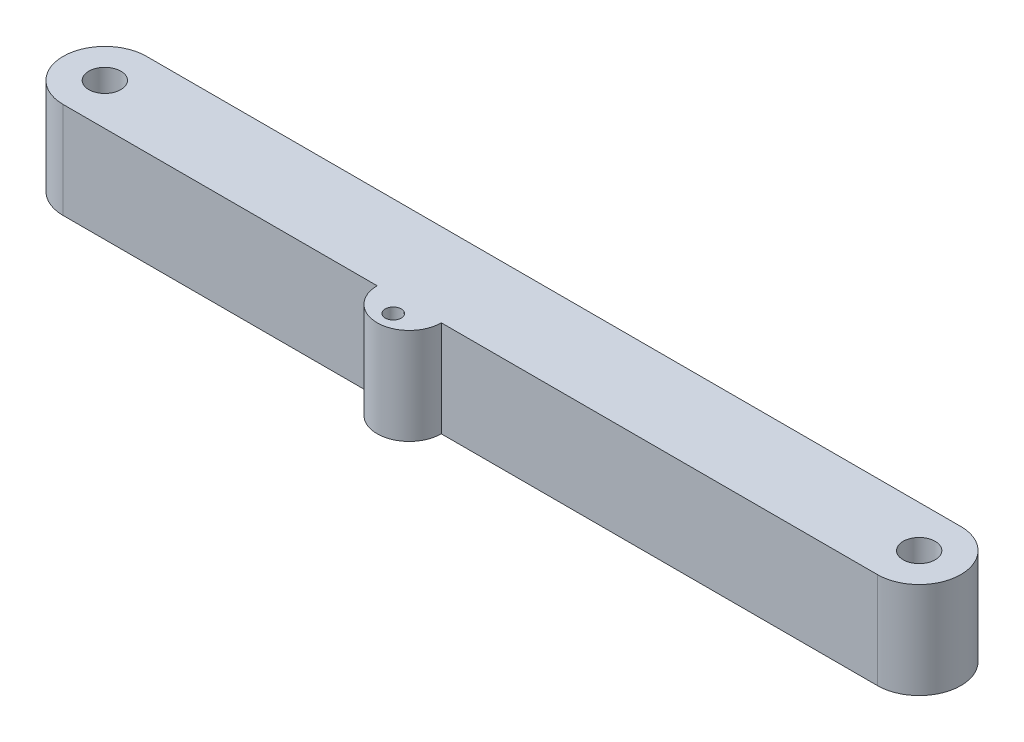
ISO-10303-21;
HEADER;
FILE_DESCRIPTION(('STEP AP214'),'2;1');
FILE_NAME('part.step','',(''),(''),'','','');
FILE_SCHEMA(('AUTOMOTIVE_DESIGN { 1 0 10303 214 1 1 1 1 }'));
ENDSEC;
DATA;
#1=APPLICATION_CONTEXT('core data for automotive mechanical design processes');
#2=APPLICATION_PROTOCOL_DEFINITION('international standard','automotive_design',2000,#1);
#3=PRODUCT_CONTEXT('',#1,'mechanical');
#4=PRODUCT('Part','Part','',(#3));
#5=PRODUCT_RELATED_PRODUCT_CATEGORY('part','',(#4));
#6=PRODUCT_DEFINITION_FORMATION('','',#4);
#7=PRODUCT_DEFINITION_CONTEXT('part definition',#1,'design');
#8=PRODUCT_DEFINITION('design','',#6,#7);
#9=PRODUCT_DEFINITION_SHAPE('','',#8);
#10=(LENGTH_UNIT() NAMED_UNIT(*) SI_UNIT(.MILLI.,.METRE.));
#11=(NAMED_UNIT(*) PLANE_ANGLE_UNIT() SI_UNIT($,.RADIAN.));
#12=(NAMED_UNIT(*) SI_UNIT($,.STERADIAN.) SOLID_ANGLE_UNIT());
#13=UNCERTAINTY_MEASURE_WITH_UNIT(LENGTH_MEASURE(1.E-05),#10,'distance_accuracy_value','');
#14=(GEOMETRIC_REPRESENTATION_CONTEXT(3) GLOBAL_UNCERTAINTY_ASSIGNED_CONTEXT((#13)) GLOBAL_UNIT_ASSIGNED_CONTEXT((#10,
#11,#12)) REPRESENTATION_CONTEXT('',''));
#15=CARTESIAN_POINT('',(0.,0.,0.));
#16=DIRECTION('',(0.,0.,1.));
#17=DIRECTION('',(1.,0.,0.));
#18=AXIS2_PLACEMENT_3D('',#15,#16,#17);
#19=CARTESIAN_POINT('',(-80.645,19.05,8.255));
#20=DIRECTION('',(0.,0.,-1.));
#21=DIRECTION('',(-1.,0.,0.));
#22=AXIS2_PLACEMENT_3D('',#19,#20,#21);
#23=PLANE('',#22);
#24=DIRECTION('',(1.,0.,0.));
#25=VECTOR('',#24,1.);
#26=CARTESIAN_POINT('',(-80.645,0.,8.255));
#27=LINE('',#26,#25);
#28=CARTESIAN_POINT('',(-80.645,0.,8.255));
#29=VERTEX_POINT('',#28);
#30=CARTESIAN_POINT('',(-18.4476136,0.,8.255));
#31=VERTEX_POINT('',#30);
#32=EDGE_CURVE('E98',#29,#31,#27,.T.);
#33=ORIENTED_EDGE('',*,*,#32,.T.);
#34=DIRECTION('',(0.,1.,0.));
#35=VECTOR('',#34,1.);
#36=CARTESIAN_POINT('',(-18.4476136,-14.1990316571237,8.255));
#37=LINE('',#36,#35);
#38=CARTESIAN_POINT('',(-18.4476136,19.05,8.255));
#39=VERTEX_POINT('',#38);
#40=EDGE_CURVE('E58',#31,#39,#37,.T.);
#41=ORIENTED_EDGE('',*,*,#40,.T.);
#42=DIRECTION('',(1.,0.,0.));
#43=VECTOR('',#42,1.);
#44=CARTESIAN_POINT('',(-80.645,19.05,8.255));
#45=LINE('',#44,#43);
#46=CARTESIAN_POINT('',(-80.645,19.05,8.255));
#47=VERTEX_POINT('',#46);
#48=EDGE_CURVE('E135',#47,#39,#45,.T.);
#49=ORIENTED_EDGE('',*,*,#48,.F.);
#50=DIRECTION('',(0.,-1.,0.));
#51=VECTOR('',#50,1.);
#52=CARTESIAN_POINT('',(-80.645,19.05,8.255));
#53=LINE('',#52,#51);
#54=EDGE_CURVE('E11',#47,#29,#53,.T.);
#55=ORIENTED_EDGE('',*,*,#54,.T.);
#56=EDGE_LOOP('',(#33,#41,#49,#55));
#57=FACE_BOUND('',#56,.T.);
#58=ADVANCED_FACE('F35',(#57),#23,.F.);
#59=CARTESIAN_POINT('',(-80.645,19.05,0.));
#60=DIRECTION('',(0.,1.,0.));
#61=DIRECTION('',(0.,0.,1.));
#62=AXIS2_PLACEMENT_3D('',#59,#60,#61);
#63=PLANE('',#62);
#64=CARTESIAN_POINT('',(-80.645,19.05,0.));
#65=DIRECTION('',(0.,1.,0.));
#66=DIRECTION('',(0.,0.,1.));
#67=AXIS2_PLACEMENT_3D('',#64,#65,#66);
#68=CIRCLE('',#67,3.175);
#69=CARTESIAN_POINT('',(-80.645,19.05,3.175));
#70=VERTEX_POINT('',#69);
#71=EDGE_CURVE('E126',#70,#70,#68,.T.);
#72=ORIENTED_EDGE('',*,*,#71,.F.);
#73=EDGE_LOOP('',(#72));
#74=FACE_BOUND('',#73,.T.);
#75=CARTESIAN_POINT('',(-80.645,19.05,0.));
#76=DIRECTION('',(0.,1.,0.));
#77=DIRECTION('',(0.,0.,1.));
#78=AXIS2_PLACEMENT_3D('',#75,#76,#77);
#79=CIRCLE('',#78,8.255);
#80=CARTESIAN_POINT('',(-80.645,19.05,-8.255));
#81=VERTEX_POINT('',#80);
#82=EDGE_CURVE('E131',#81,#47,#79,.T.);
#83=ORIENTED_EDGE('',*,*,#82,.T.);
#84=ORIENTED_EDGE('',*,*,#48,.T.);
#85=CARTESIAN_POINT('',(-12.0976136,19.05,8.255));
#86=DIRECTION('',(0.,1.,0.));
#87=DIRECTION('',(0.,0.,1.));
#88=AXIS2_PLACEMENT_3D('',#85,#86,#87);
#89=CIRCLE('',#88,6.35);
#90=CARTESIAN_POINT('',(-5.74761360000001,19.05,8.255));
#91=VERTEX_POINT('',#90);
#92=EDGE_CURVE('E106',#39,#91,#89,.T.);
#93=ORIENTED_EDGE('',*,*,#92,.T.);
#94=CARTESIAN_POINT('',(80.645,19.05,8.255));
#95=VERTEX_POINT('',#94);
#96=EDGE_CURVE('E50',#91,#95,#45,.T.);
#97=ORIENTED_EDGE('',*,*,#96,.T.);
#98=CARTESIAN_POINT('',(80.645,19.05,0.));
#99=DIRECTION('',(0.,1.,0.));
#100=DIRECTION('',(0.,0.,-1.));
#101=AXIS2_PLACEMENT_3D('',#98,#99,#100);
#102=CIRCLE('',#101,8.255);
#103=CARTESIAN_POINT('',(80.645,19.05,-8.255));
#104=VERTEX_POINT('',#103);
#105=EDGE_CURVE('E137',#95,#104,#102,.T.);
#106=ORIENTED_EDGE('',*,*,#105,.T.);
#107=DIRECTION('',(-1.,0.,0.));
#108=VECTOR('',#107,1.);
#109=CARTESIAN_POINT('',(-80.645,19.05,-8.255));
#110=LINE('',#109,#108);
#111=EDGE_CURVE('E139',#104,#81,#110,.T.);
#112=ORIENTED_EDGE('',*,*,#111,.T.);
#113=EDGE_LOOP('',(#83,#84,#93,#97,#106,#112));
#114=FACE_BOUND('',#113,.T.);
#115=CARTESIAN_POINT('',(80.645,19.05,0.));
#116=DIRECTION('',(0.,1.,0.));
#117=DIRECTION('',(0.,0.,1.));
#118=AXIS2_PLACEMENT_3D('',#115,#116,#117);
#119=CIRCLE('',#118,3.175);
#120=CARTESIAN_POINT('',(80.645,19.05,3.175));
#121=VERTEX_POINT('',#120);
#122=EDGE_CURVE('E120',#121,#121,#119,.T.);
#123=ORIENTED_EDGE('',*,*,#122,.F.);
#124=EDGE_LOOP('',(#123));
#125=FACE_BOUND('',#124,.T.);
#126=CARTESIAN_POINT('',(-12.0976136,19.05,11.43));
#127=DIRECTION('',(0.,1.,0.));
#128=DIRECTION('',(0.,0.,1.));
#129=AXIS2_PLACEMENT_3D('',#126,#127,#128);
#130=CIRCLE('',#129,1.5875);
#131=CARTESIAN_POINT('',(-12.0976136,19.05,13.0175));
#132=VERTEX_POINT('',#131);
#133=EDGE_CURVE('E116',#132,#132,#130,.T.);
#134=ORIENTED_EDGE('',*,*,#133,.F.);
#135=EDGE_LOOP('',(#134));
#136=FACE_BOUND('',#135,.T.);
#137=ADVANCED_FACE('F156',(#74,#114,#125,#136),#63,.T.);
#138=CARTESIAN_POINT('',(-80.645,0.,0.));
#139=DIRECTION('',(0.,1.,0.));
#140=DIRECTION('',(0.,0.,1.));
#141=AXIS2_PLACEMENT_3D('',#138,#139,#140);
#142=PLANE('',#141);
#143=CARTESIAN_POINT('',(-80.645,0.,0.));
#144=DIRECTION('',(0.,1.,0.));
#145=DIRECTION('',(0.,0.,1.));
#146=AXIS2_PLACEMENT_3D('',#143,#144,#145);
#147=CIRCLE('',#146,8.255);
#148=CARTESIAN_POINT('',(-80.645,0.,-8.255));
#149=VERTEX_POINT('',#148);
#150=EDGE_CURVE('E99',#149,#29,#147,.T.);
#151=ORIENTED_EDGE('',*,*,#150,.F.);
#152=DIRECTION('',(-1.,0.,0.));
#153=VECTOR('',#152,1.);
#154=CARTESIAN_POINT('',(-80.645,0.,-8.255));
#155=LINE('',#154,#153);
#156=CARTESIAN_POINT('',(80.645,0.,-8.255));
#157=VERTEX_POINT('',#156);
#158=EDGE_CURVE('E134',#157,#149,#155,.T.);
#159=ORIENTED_EDGE('',*,*,#158,.F.);
#160=CARTESIAN_POINT('',(80.645,0.,0.));
#161=DIRECTION('',(0.,1.,0.));
#162=DIRECTION('',(0.,0.,-1.));
#163=AXIS2_PLACEMENT_3D('',#160,#161,#162);
#164=CIRCLE('',#163,8.255);
#165=CARTESIAN_POINT('',(80.645,0.,8.255));
#166=VERTEX_POINT('',#165);
#167=EDGE_CURVE('E96',#166,#157,#164,.T.);
#168=ORIENTED_EDGE('',*,*,#167,.F.);
#169=CARTESIAN_POINT('',(-5.7476136,0.,8.255));
#170=VERTEX_POINT('',#169);
#171=EDGE_CURVE('E89',#170,#166,#27,.T.);
#172=ORIENTED_EDGE('',*,*,#171,.F.);
#173=CARTESIAN_POINT('',(-12.0976136,0.,8.255));
#174=DIRECTION('',(0.,1.,0.));
#175=DIRECTION('',(0.,0.,1.));
#176=AXIS2_PLACEMENT_3D('',#173,#174,#175);
#177=CIRCLE('',#176,6.35);
#178=EDGE_CURVE('E94',#170,#31,#177,.F.);
#179=ORIENTED_EDGE('',*,*,#178,.T.);
#180=ORIENTED_EDGE('',*,*,#32,.F.);
#181=EDGE_LOOP('',(#151,#159,#168,#172,#179,#180));
#182=FACE_BOUND('',#181,.T.);
#183=CARTESIAN_POINT('',(-80.645,0.,0.));
#184=DIRECTION('',(0.,1.,0.));
#185=DIRECTION('',(0.,0.,1.));
#186=AXIS2_PLACEMENT_3D('',#183,#184,#185);
#187=CIRCLE('',#186,3.175);
#188=CARTESIAN_POINT('',(-80.645,0.,3.175));
#189=VERTEX_POINT('',#188);
#190=EDGE_CURVE('E123',#189,#189,#187,.T.);
#191=ORIENTED_EDGE('',*,*,#190,.T.);
#192=EDGE_LOOP('',(#191));
#193=FACE_BOUND('',#192,.T.);
#194=CARTESIAN_POINT('',(80.645,0.,0.));
#195=DIRECTION('',(0.,1.,0.));
#196=DIRECTION('',(0.,0.,1.));
#197=AXIS2_PLACEMENT_3D('',#194,#195,#196);
#198=CIRCLE('',#197,3.175);
#199=CARTESIAN_POINT('',(80.645,0.,3.175));
#200=VERTEX_POINT('',#199);
#201=EDGE_CURVE('E112',#200,#200,#198,.T.);
#202=ORIENTED_EDGE('',*,*,#201,.T.);
#203=EDGE_LOOP('',(#202));
#204=FACE_BOUND('',#203,.T.);
#205=CARTESIAN_POINT('',(-12.0976136,0.,11.43));
#206=DIRECTION('',(0.,1.,0.));
#207=DIRECTION('',(0.,0.,1.));
#208=AXIS2_PLACEMENT_3D('',#205,#206,#207);
#209=CIRCLE('',#208,1.5875);
#210=CARTESIAN_POINT('',(-12.0976136,0.,13.0175));
#211=VERTEX_POINT('',#210);
#212=EDGE_CURVE('E109',#211,#211,#209,.F.);
#213=ORIENTED_EDGE('',*,*,#212,.F.);
#214=EDGE_LOOP('',(#213));
#215=FACE_BOUND('',#214,.T.);
#216=ADVANCED_FACE('F91',(#182,#193,#204,#215),#142,.F.);
#217=CARTESIAN_POINT('',(-80.645,19.05,0.));
#218=DIRECTION('',(0.,-1.,0.));
#219=DIRECTION('',(0.,0.,-1.));
#220=AXIS2_PLACEMENT_3D('',#217,#218,#219);
#221=CYLINDRICAL_SURFACE('',#220,8.255);
#222=ORIENTED_EDGE('',*,*,#150,.T.);
#223=ORIENTED_EDGE('',*,*,#54,.F.);
#224=ORIENTED_EDGE('',*,*,#82,.F.);
#225=DIRECTION('',(0.,-1.,0.));
#226=VECTOR('',#225,1.);
#227=CARTESIAN_POINT('',(-80.645,19.05,-8.255));
#228=LINE('',#227,#226);
#229=EDGE_CURVE('E141',#81,#149,#228,.T.);
#230=ORIENTED_EDGE('',*,*,#229,.T.);
#231=EDGE_LOOP('',(#222,#223,#224,#230));
#232=FACE_BOUND('',#231,.T.);
#233=ADVANCED_FACE('F37',(#232),#221,.T.);
#234=ORIENTED_EDGE('',*,*,#96,.F.);
#235=DIRECTION('',(0.,1.,0.));
#236=VECTOR('',#235,1.);
#237=CARTESIAN_POINT('',(-5.7476136,-14.1990316571237,8.255));
#238=LINE('',#237,#236);
#239=EDGE_CURVE('E101',#170,#91,#238,.T.);
#240=ORIENTED_EDGE('',*,*,#239,.F.);
#241=ORIENTED_EDGE('',*,*,#171,.T.);
#242=DIRECTION('',(0.,-1.,0.));
#243=VECTOR('',#242,1.);
#244=CARTESIAN_POINT('',(80.645,19.05,8.255));
#245=LINE('',#244,#243);
#246=EDGE_CURVE('E43',#95,#166,#245,.T.);
#247=ORIENTED_EDGE('',*,*,#246,.F.);
#248=EDGE_LOOP('',(#234,#240,#241,#247));
#249=FACE_BOUND('',#248,.T.);
#250=ADVANCED_FACE('F102',(#249),#23,.F.);
#251=CARTESIAN_POINT('',(80.645,19.05,0.));
#252=DIRECTION('',(0.,-1.,0.));
#253=DIRECTION('',(0.,0.,-1.));
#254=AXIS2_PLACEMENT_3D('',#251,#252,#253);
#255=CYLINDRICAL_SURFACE('',#254,8.255);
#256=ORIENTED_EDGE('',*,*,#167,.T.);
#257=DIRECTION('',(0.,-1.,0.));
#258=VECTOR('',#257,1.);
#259=CARTESIAN_POINT('',(80.645,19.05,-8.255));
#260=LINE('',#259,#258);
#261=EDGE_CURVE('E148',#104,#157,#260,.T.);
#262=ORIENTED_EDGE('',*,*,#261,.F.);
#263=ORIENTED_EDGE('',*,*,#105,.F.);
#264=ORIENTED_EDGE('',*,*,#246,.T.);
#265=EDGE_LOOP('',(#256,#262,#263,#264));
#266=FACE_BOUND('',#265,.T.);
#267=ADVANCED_FACE('F152',(#266),#255,.T.);
#268=CARTESIAN_POINT('',(-80.645,19.05,-8.255));
#269=DIRECTION('',(0.,0.,1.));
#270=DIRECTION('',(1.,0.,0.));
#271=AXIS2_PLACEMENT_3D('',#268,#269,#270);
#272=PLANE('',#271);
#273=ORIENTED_EDGE('',*,*,#158,.T.);
#274=ORIENTED_EDGE('',*,*,#229,.F.);
#275=ORIENTED_EDGE('',*,*,#111,.F.);
#276=ORIENTED_EDGE('',*,*,#261,.T.);
#277=EDGE_LOOP('',(#273,#274,#275,#276));
#278=FACE_BOUND('',#277,.T.);
#279=ADVANCED_FACE('F163',(#278),#272,.F.);
#280=CARTESIAN_POINT('',(-80.645,19.05,0.));
#281=DIRECTION('',(0.,-1.,0.));
#282=DIRECTION('',(0.,0.,-1.));
#283=AXIS2_PLACEMENT_3D('',#280,#281,#282);
#284=CYLINDRICAL_SURFACE('',#283,3.175);
#285=ORIENTED_EDGE('',*,*,#71,.T.);
#286=EDGE_LOOP('',(#285));
#287=FACE_BOUND('',#286,.T.);
#288=ORIENTED_EDGE('',*,*,#190,.F.);
#289=EDGE_LOOP('',(#288));
#290=FACE_BOUND('',#289,.T.);
#291=ADVANCED_FACE('F165',(#287,#290),#284,.F.);
#292=CARTESIAN_POINT('',(80.645,19.05,0.));
#293=DIRECTION('',(0.,-1.,0.));
#294=DIRECTION('',(0.,0.,-1.));
#295=AXIS2_PLACEMENT_3D('',#292,#293,#294);
#296=CYLINDRICAL_SURFACE('',#295,3.175);
#297=ORIENTED_EDGE('',*,*,#122,.T.);
#298=EDGE_LOOP('',(#297));
#299=FACE_BOUND('',#298,.T.);
#300=ORIENTED_EDGE('',*,*,#201,.F.);
#301=EDGE_LOOP('',(#300));
#302=FACE_BOUND('',#301,.T.);
#303=ADVANCED_FACE('F171',(#299,#302),#296,.F.);
#304=CARTESIAN_POINT('',(-12.0976136,-14.1990316571237,11.43));
#305=DIRECTION('',(0.,1.,0.));
#306=DIRECTION('',(0.,0.,1.));
#307=AXIS2_PLACEMENT_3D('',#304,#305,#306);
#308=CYLINDRICAL_SURFACE('',#307,1.5875);
#309=ORIENTED_EDGE('',*,*,#212,.T.);
#310=EDGE_LOOP('',(#309));
#311=FACE_BOUND('',#310,.T.);
#312=ORIENTED_EDGE('',*,*,#133,.T.);
#313=EDGE_LOOP('',(#312));
#314=FACE_BOUND('',#313,.T.);
#315=ADVANCED_FACE('F194',(#311,#314),#308,.F.);
#316=CARTESIAN_POINT('',(-12.0976136,-14.1990316571237,8.255));
#317=DIRECTION('',(0.,1.,0.));
#318=DIRECTION('',(0.,0.,1.));
#319=AXIS2_PLACEMENT_3D('',#316,#317,#318);
#320=CYLINDRICAL_SURFACE('',#319,6.35);
#321=ORIENTED_EDGE('',*,*,#178,.F.);
#322=ORIENTED_EDGE('',*,*,#239,.T.);
#323=ORIENTED_EDGE('',*,*,#92,.F.);
#324=ORIENTED_EDGE('',*,*,#40,.F.);
#325=EDGE_LOOP('',(#321,#322,#323,#324));
#326=FACE_BOUND('',#325,.T.);
#327=ADVANCED_FACE('F108',(#326),#320,.T.);
#328=CLOSED_SHELL('',(#58,#137,#216,#233,#250,#267,#279,#291,#303,#315,#327));
#329=MANIFOLD_SOLID_BREP('B2',#328);
#330=ADVANCED_BREP_SHAPE_REPRESENTATION('',(#18,#329),#14);
#331=SHAPE_DEFINITION_REPRESENTATION(#9,#330);
ENDSEC;
END-ISO-10303-21;
